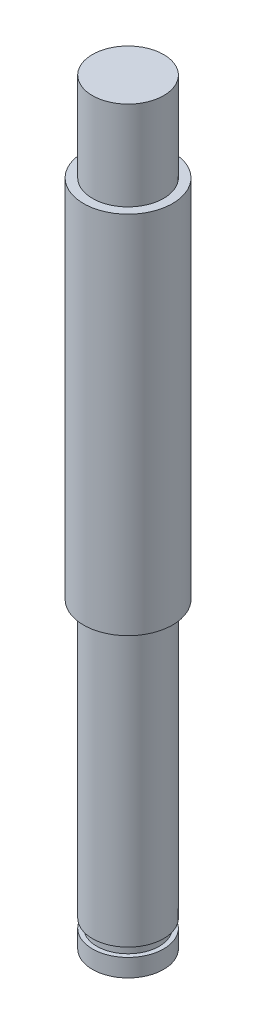
ISO-10303-21;
HEADER;
FILE_DESCRIPTION(('STEP AP214'),'2;1');
FILE_NAME('part.step','',(''),(''),'','','');
FILE_SCHEMA(('AUTOMOTIVE_DESIGN { 1 0 10303 214 1 1 1 1 }'));
ENDSEC;
DATA;
#1=APPLICATION_CONTEXT('core data for automotive mechanical design processes');
#2=APPLICATION_PROTOCOL_DEFINITION('international standard','automotive_design',2000,#1);
#3=PRODUCT_CONTEXT('',#1,'mechanical');
#4=PRODUCT('Part','Part','',(#3));
#5=PRODUCT_RELATED_PRODUCT_CATEGORY('part','',(#4));
#6=PRODUCT_DEFINITION_FORMATION('','',#4);
#7=PRODUCT_DEFINITION_CONTEXT('part definition',#1,'design');
#8=PRODUCT_DEFINITION('design','',#6,#7);
#9=PRODUCT_DEFINITION_SHAPE('','',#8);
#10=(LENGTH_UNIT() NAMED_UNIT(*) SI_UNIT(.MILLI.,.METRE.));
#11=(NAMED_UNIT(*) PLANE_ANGLE_UNIT() SI_UNIT($,.RADIAN.));
#12=(NAMED_UNIT(*) SI_UNIT($,.STERADIAN.) SOLID_ANGLE_UNIT());
#13=UNCERTAINTY_MEASURE_WITH_UNIT(LENGTH_MEASURE(1.E-05),#10,'distance_accuracy_value','');
#14=(GEOMETRIC_REPRESENTATION_CONTEXT(3) GLOBAL_UNCERTAINTY_ASSIGNED_CONTEXT((#13)) GLOBAL_UNIT_ASSIGNED_CONTEXT((#10,
#11,#12)) REPRESENTATION_CONTEXT('',''));
#15=CARTESIAN_POINT('',(0.,0.,0.));
#16=DIRECTION('',(0.,0.,1.));
#17=DIRECTION('',(1.,0.,0.));
#18=AXIS2_PLACEMENT_3D('',#15,#16,#17);
#19=CARTESIAN_POINT('',(0.,-34.,0.));
#20=DIRECTION('',(0.,-1.,0.));
#21=DIRECTION('',(0.,0.,-1.));
#22=AXIS2_PLACEMENT_3D('',#19,#20,#21);
#23=PLANE('',#22);
#24=CARTESIAN_POINT('',(0.,-34.,0.));
#25=DIRECTION('',(0.,-1.,0.));
#26=DIRECTION('',(0.,0.,-1.));
#27=AXIS2_PLACEMENT_3D('',#24,#25,#26);
#28=CIRCLE('',#27,4.);
#29=CARTESIAN_POINT('',(0.,-34.,-4.));
#30=VERTEX_POINT('',#29);
#31=EDGE_CURVE('E17',#30,#30,#28,.F.);
#32=ORIENTED_EDGE('',*,*,#31,.F.);
#33=EDGE_LOOP('',(#32));
#34=FACE_BOUND('',#33,.T.);
#35=ADVANCED_FACE('F14',(#34),#23,.T.);
#36=CARTESIAN_POINT('',(0.,0.,0.));
#37=DIRECTION('',(0.,-1.,0.));
#38=DIRECTION('',(0.,0.,-1.));
#39=AXIS2_PLACEMENT_3D('',#36,#37,#38);
#40=CYLINDRICAL_SURFACE('',#39,4.);
#41=ORIENTED_EDGE('',*,*,#31,.T.);
#42=EDGE_LOOP('',(#41));
#43=FACE_BOUND('',#42,.T.);
#44=CARTESIAN_POINT('',(0.,-32.,0.));
#45=DIRECTION('',(0.,-1.,0.));
#46=DIRECTION('',(0.,0.,-1.));
#47=AXIS2_PLACEMENT_3D('',#44,#45,#46);
#48=CIRCLE('',#47,4.);
#49=CARTESIAN_POINT('',(0.,-32.,-4.));
#50=VERTEX_POINT('',#49);
#51=EDGE_CURVE('E45',#50,#50,#48,.T.);
#52=ORIENTED_EDGE('',*,*,#51,.T.);
#53=EDGE_LOOP('',(#52));
#54=FACE_BOUND('',#53,.T.);
#55=ADVANCED_FACE('F52',(#43,#54),#40,.T.);
#56=CARTESIAN_POINT('',(0.,-32.,0.));
#57=DIRECTION('',(0.,-1.,0.));
#58=DIRECTION('',(0.,0.,-1.));
#59=AXIS2_PLACEMENT_3D('',#56,#57,#58);
#60=PLANE('',#59);
#61=CARTESIAN_POINT('',(0.,-32.,0.));
#62=DIRECTION('',(0.,-1.,0.));
#63=DIRECTION('',(0.,0.,-1.));
#64=AXIS2_PLACEMENT_3D('',#61,#62,#63);
#65=CIRCLE('',#64,3.5);
#66=CARTESIAN_POINT('',(0.,-32.,-3.5));
#67=VERTEX_POINT('',#66);
#68=EDGE_CURVE('E43',#67,#67,#65,.F.);
#69=ORIENTED_EDGE('',*,*,#68,.F.);
#70=EDGE_LOOP('',(#69));
#71=FACE_BOUND('',#70,.T.);
#72=ORIENTED_EDGE('',*,*,#51,.F.);
#73=EDGE_LOOP('',(#72));
#74=FACE_BOUND('',#73,.T.);
#75=ADVANCED_FACE('F59',(#71,#74),#60,.F.);
#76=CARTESIAN_POINT('',(0.,0.,0.));
#77=DIRECTION('',(0.,-1.,0.));
#78=DIRECTION('',(0.,0.,-1.));
#79=AXIS2_PLACEMENT_3D('',#76,#77,#78);
#80=CYLINDRICAL_SURFACE('',#79,3.5);
#81=CARTESIAN_POINT('',(0.,-31.,0.));
#82=DIRECTION('',(0.,-1.,0.));
#83=DIRECTION('',(0.,0.,-1.));
#84=AXIS2_PLACEMENT_3D('',#81,#82,#83);
#85=CIRCLE('',#84,3.5);
#86=CARTESIAN_POINT('',(0.,-31.,-3.5));
#87=VERTEX_POINT('',#86);
#88=EDGE_CURVE('E40',#87,#87,#85,.F.);
#89=ORIENTED_EDGE('',*,*,#88,.F.);
#90=EDGE_LOOP('',(#89));
#91=FACE_BOUND('',#90,.T.);
#92=ORIENTED_EDGE('',*,*,#68,.T.);
#93=EDGE_LOOP('',(#92));
#94=FACE_BOUND('',#93,.T.);
#95=ADVANCED_FACE('F90',(#91,#94),#80,.T.);
#96=CARTESIAN_POINT('',(0.,51.,0.));
#97=DIRECTION('',(0.,-1.,0.));
#98=DIRECTION('',(0.,0.,-1.));
#99=AXIS2_PLACEMENT_3D('',#96,#97,#98);
#100=PLANE('',#99);
#101=CARTESIAN_POINT('',(0.,51.,0.));
#102=DIRECTION('',(0.,-1.,0.));
#103=DIRECTION('',(0.,0.,-1.));
#104=AXIS2_PLACEMENT_3D('',#101,#102,#103);
#105=CIRCLE('',#104,4.);
#106=CARTESIAN_POINT('',(0.,51.,-4.));
#107=VERTEX_POINT('',#106);
#108=EDGE_CURVE('E37',#107,#107,#105,.T.);
#109=ORIENTED_EDGE('',*,*,#108,.F.);
#110=EDGE_LOOP('',(#109));
#111=FACE_BOUND('',#110,.T.);
#112=ADVANCED_FACE('F86',(#111),#100,.F.);
#113=CARTESIAN_POINT('',(0.,-31.,0.));
#114=DIRECTION('',(0.,-1.,0.));
#115=DIRECTION('',(0.,0.,-1.));
#116=AXIS2_PLACEMENT_3D('',#113,#114,#115);
#117=PLANE('',#116);
#118=ORIENTED_EDGE('',*,*,#88,.T.);
#119=EDGE_LOOP('',(#118));
#120=FACE_BOUND('',#119,.T.);
#121=CARTESIAN_POINT('',(0.,-31.,0.));
#122=DIRECTION('',(0.,-1.,0.));
#123=DIRECTION('',(0.,0.,-1.));
#124=AXIS2_PLACEMENT_3D('',#121,#122,#123);
#125=CIRCLE('',#124,4.);
#126=CARTESIAN_POINT('',(0.,-31.,-4.));
#127=VERTEX_POINT('',#126);
#128=EDGE_CURVE('E34',#127,#127,#125,.F.);
#129=ORIENTED_EDGE('',*,*,#128,.F.);
#130=EDGE_LOOP('',(#129));
#131=FACE_BOUND('',#130,.T.);
#132=ADVANCED_FACE('F82',(#120,#131),#117,.T.);
#133=CARTESIAN_POINT('',(0.,0.,0.));
#134=DIRECTION('',(0.,-1.,0.));
#135=DIRECTION('',(0.,0.,-1.));
#136=AXIS2_PLACEMENT_3D('',#133,#134,#135);
#137=CYLINDRICAL_SURFACE('',#136,4.);
#138=ORIENTED_EDGE('',*,*,#108,.T.);
#139=EDGE_LOOP('',(#138));
#140=FACE_BOUND('',#139,.T.);
#141=CARTESIAN_POINT('',(0.,41.,0.));
#142=DIRECTION('',(0.,-1.,0.));
#143=DIRECTION('',(0.,0.,-1.));
#144=AXIS2_PLACEMENT_3D('',#141,#142,#143);
#145=CIRCLE('',#144,4.);
#146=CARTESIAN_POINT('',(0.,41.,-4.));
#147=VERTEX_POINT('',#146);
#148=EDGE_CURVE('E31',#147,#147,#145,.F.);
#149=ORIENTED_EDGE('',*,*,#148,.T.);
#150=EDGE_LOOP('',(#149));
#151=FACE_BOUND('',#150,.T.);
#152=ADVANCED_FACE('F78',(#140,#151),#137,.T.);
#153=CARTESIAN_POINT('',(0.,0.,0.));
#154=DIRECTION('',(0.,-1.,0.));
#155=DIRECTION('',(0.,0.,-1.));
#156=AXIS2_PLACEMENT_3D('',#153,#154,#155);
#157=CYLINDRICAL_SURFACE('',#156,4.);
#158=CARTESIAN_POINT('',(0.,0.,0.));
#159=DIRECTION('',(0.,-1.,0.));
#160=DIRECTION('',(0.,0.,-1.));
#161=AXIS2_PLACEMENT_3D('',#158,#159,#160);
#162=CIRCLE('',#161,4.);
#163=CARTESIAN_POINT('',(0.,0.,-4.));
#164=VERTEX_POINT('',#163);
#165=EDGE_CURVE('E26',#164,#164,#162,.F.);
#166=ORIENTED_EDGE('',*,*,#165,.F.);
#167=EDGE_LOOP('',(#166));
#168=FACE_BOUND('',#167,.T.);
#169=ORIENTED_EDGE('',*,*,#128,.T.);
#170=EDGE_LOOP('',(#169));
#171=FACE_BOUND('',#170,.T.);
#172=ADVANCED_FACE('F74',(#168,#171),#157,.T.);
#173=CARTESIAN_POINT('',(0.,41.,0.));
#174=DIRECTION('',(0.,-1.,0.));
#175=DIRECTION('',(0.,0.,-1.));
#176=AXIS2_PLACEMENT_3D('',#173,#174,#175);
#177=PLANE('',#176);
#178=ORIENTED_EDGE('',*,*,#148,.F.);
#179=EDGE_LOOP('',(#178));
#180=FACE_BOUND('',#179,.T.);
#181=CARTESIAN_POINT('',(0.,41.,0.));
#182=DIRECTION('',(0.,-1.,0.));
#183=DIRECTION('',(0.,0.,-1.));
#184=AXIS2_PLACEMENT_3D('',#181,#182,#183);
#185=CIRCLE('',#184,5.);
#186=CARTESIAN_POINT('',(0.,41.,-5.));
#187=VERTEX_POINT('',#186);
#188=EDGE_CURVE('E21',#187,#187,#185,.T.);
#189=ORIENTED_EDGE('',*,*,#188,.F.);
#190=EDGE_LOOP('',(#189));
#191=FACE_BOUND('',#190,.T.);
#192=ADVANCED_FACE('F67',(#180,#191),#177,.F.);
#193=CARTESIAN_POINT('',(0.,0.,0.));
#194=DIRECTION('',(0.,-1.,0.));
#195=DIRECTION('',(0.,0.,-1.));
#196=AXIS2_PLACEMENT_3D('',#193,#194,#195);
#197=PLANE('',#196);
#198=ORIENTED_EDGE('',*,*,#165,.T.);
#199=EDGE_LOOP('',(#198));
#200=FACE_BOUND('',#199,.T.);
#201=CARTESIAN_POINT('',(0.,0.,0.));
#202=DIRECTION('',(0.,-1.,0.));
#203=DIRECTION('',(0.,0.,-1.));
#204=AXIS2_PLACEMENT_3D('',#201,#202,#203);
#205=CIRCLE('',#204,5.);
#206=CARTESIAN_POINT('',(0.,0.,-5.));
#207=VERTEX_POINT('',#206);
#208=EDGE_CURVE('E10',#207,#207,#205,.F.);
#209=ORIENTED_EDGE('',*,*,#208,.F.);
#210=EDGE_LOOP('',(#209));
#211=FACE_BOUND('',#210,.T.);
#212=ADVANCED_FACE('F62',(#200,#211),#197,.T.);
#213=CARTESIAN_POINT('',(0.,0.,0.));
#214=DIRECTION('',(0.,-1.,0.));
#215=DIRECTION('',(0.,0.,-1.));
#216=AXIS2_PLACEMENT_3D('',#213,#214,#215);
#217=CYLINDRICAL_SURFACE('',#216,5.);
#218=ORIENTED_EDGE('',*,*,#208,.T.);
#219=EDGE_LOOP('',(#218));
#220=FACE_BOUND('',#219,.T.);
#221=ORIENTED_EDGE('',*,*,#188,.T.);
#222=EDGE_LOOP('',(#221));
#223=FACE_BOUND('',#222,.T.);
#224=ADVANCED_FACE('F60',(#220,#223),#217,.T.);
#225=CLOSED_SHELL('',(#35,#55,#75,#95,#112,#132,#152,#172,#192,#212,#224));
#226=MANIFOLD_SOLID_BREP('B1',#225);
#227=ADVANCED_BREP_SHAPE_REPRESENTATION('',(#18,#226),#14);
#228=SHAPE_DEFINITION_REPRESENTATION(#9,#227);
ENDSEC;
END-ISO-10303-21;
